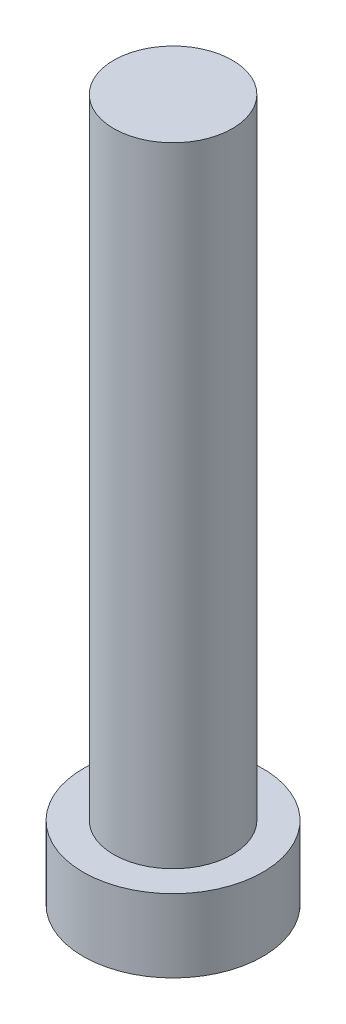
ISO-10303-21;
HEADER;
FILE_DESCRIPTION(('STEP AP214'),'2;1');
FILE_NAME('part.step','',(''),(''),'','','');
FILE_SCHEMA(('AUTOMOTIVE_DESIGN { 1 0 10303 214 1 1 1 1 }'));
ENDSEC;
DATA;
#1=APPLICATION_CONTEXT('core data for automotive mechanical design processes');
#2=APPLICATION_PROTOCOL_DEFINITION('international standard','automotive_design',2000,#1);
#3=PRODUCT_CONTEXT('',#1,'mechanical');
#4=PRODUCT('Part','Part','',(#3));
#5=PRODUCT_RELATED_PRODUCT_CATEGORY('part','',(#4));
#6=PRODUCT_DEFINITION_FORMATION('','',#4);
#7=PRODUCT_DEFINITION_CONTEXT('part definition',#1,'design');
#8=PRODUCT_DEFINITION('design','',#6,#7);
#9=PRODUCT_DEFINITION_SHAPE('','',#8);
#10=(LENGTH_UNIT() NAMED_UNIT(*) SI_UNIT(.MILLI.,.METRE.));
#11=(NAMED_UNIT(*) PLANE_ANGLE_UNIT() SI_UNIT($,.RADIAN.));
#12=(NAMED_UNIT(*) SI_UNIT($,.STERADIAN.) SOLID_ANGLE_UNIT());
#13=UNCERTAINTY_MEASURE_WITH_UNIT(LENGTH_MEASURE(1.E-05),#10,'distance_accuracy_value','');
#14=(GEOMETRIC_REPRESENTATION_CONTEXT(3) GLOBAL_UNCERTAINTY_ASSIGNED_CONTEXT((#13)) GLOBAL_UNIT_ASSIGNED_CONTEXT((#10,
#11,#12)) REPRESENTATION_CONTEXT('',''));
#15=CARTESIAN_POINT('',(0.,0.,0.));
#16=DIRECTION('',(0.,0.,1.));
#17=DIRECTION('',(1.,0.,0.));
#18=AXIS2_PLACEMENT_3D('',#15,#16,#17);
#19=CARTESIAN_POINT('',(0.,4.064,0.));
#20=DIRECTION('',(0.,-1.,0.));
#21=DIRECTION('',(0.,0.,-1.));
#22=AXIS2_PLACEMENT_3D('',#19,#20,#21);
#23=CYLINDRICAL_SURFACE('',#22,5.);
#24=CARTESIAN_POINT('',(0.,4.064,0.));
#25=DIRECTION('',(0.,1.,0.));
#26=DIRECTION('',(0.,0.,1.));
#27=AXIS2_PLACEMENT_3D('',#24,#25,#26);
#28=CIRCLE('',#27,5.);
#29=CARTESIAN_POINT('',(0.,4.064,5.));
#30=VERTEX_POINT('',#29);
#31=EDGE_CURVE('E10',#30,#30,#28,.T.);
#32=ORIENTED_EDGE('',*,*,#31,.F.);
#33=EDGE_LOOP('',(#32));
#34=FACE_BOUND('',#33,.T.);
#35=CARTESIAN_POINT('',(0.,0.,0.));
#36=DIRECTION('',(0.,1.,0.));
#37=DIRECTION('',(0.,0.,1.));
#38=AXIS2_PLACEMENT_3D('',#35,#36,#37);
#39=CIRCLE('',#38,5.);
#40=CARTESIAN_POINT('',(0.,0.,5.));
#41=VERTEX_POINT('',#40);
#42=EDGE_CURVE('E33',#41,#41,#39,.T.);
#43=ORIENTED_EDGE('',*,*,#42,.T.);
#44=EDGE_LOOP('',(#43));
#45=FACE_BOUND('',#44,.T.);
#46=ADVANCED_FACE('F30',(#34,#45),#23,.T.);
#47=CARTESIAN_POINT('',(0.,4.064,0.));
#48=DIRECTION('',(0.,1.,0.));
#49=DIRECTION('',(0.,0.,1.));
#50=AXIS2_PLACEMENT_3D('',#47,#48,#49);
#51=PLANE('',#50);
#52=CARTESIAN_POINT('',(0.,4.064,0.));
#53=DIRECTION('',(0.,1.,0.));
#54=DIRECTION('',(0.,0.,1.));
#55=AXIS2_PLACEMENT_3D('',#52,#53,#54);
#56=CIRCLE('',#55,3.3);
#57=CARTESIAN_POINT('',(0.,4.064,3.3));
#58=VERTEX_POINT('',#57);
#59=EDGE_CURVE('E40',#58,#58,#56,.F.);
#60=ORIENTED_EDGE('',*,*,#59,.T.);
#61=EDGE_LOOP('',(#60));
#62=FACE_BOUND('',#61,.T.);
#63=ORIENTED_EDGE('',*,*,#31,.T.);
#64=EDGE_LOOP('',(#63));
#65=FACE_BOUND('',#64,.T.);
#66=ADVANCED_FACE('F60',(#62,#65),#51,.T.);
#67=CARTESIAN_POINT('',(0.,0.,0.));
#68=DIRECTION('',(0.,1.,0.));
#69=DIRECTION('',(0.,0.,1.));
#70=AXIS2_PLACEMENT_3D('',#67,#68,#69);
#71=PLANE('',#70);
#72=ORIENTED_EDGE('',*,*,#42,.F.);
#73=EDGE_LOOP('',(#72));
#74=FACE_BOUND('',#73,.T.);
#75=ADVANCED_FACE('F52',(#74),#71,.F.);
#76=CARTESIAN_POINT('',(0.,39.0652,0.));
#77=DIRECTION('',(0.,-1.,0.));
#78=DIRECTION('',(0.,0.,-1.));
#79=AXIS2_PLACEMENT_3D('',#76,#77,#78);
#80=CYLINDRICAL_SURFACE('',#79,3.3);
#81=ORIENTED_EDGE('',*,*,#59,.F.);
#82=EDGE_LOOP('',(#81));
#83=FACE_BOUND('',#82,.T.);
#84=CARTESIAN_POINT('',(0.,39.0652,0.));
#85=DIRECTION('',(0.,1.,0.));
#86=DIRECTION('',(0.,0.,1.));
#87=AXIS2_PLACEMENT_3D('',#84,#85,#86);
#88=CIRCLE('',#87,3.3);
#89=CARTESIAN_POINT('',(0.,39.0652,3.3));
#90=VERTEX_POINT('',#89);
#91=EDGE_CURVE('E44',#90,#90,#88,.T.);
#92=ORIENTED_EDGE('',*,*,#91,.F.);
#93=EDGE_LOOP('',(#92));
#94=FACE_BOUND('',#93,.T.);
#95=ADVANCED_FACE('F50',(#83,#94),#80,.T.);
#96=CARTESIAN_POINT('',(0.,39.0652,0.));
#97=DIRECTION('',(0.,1.,0.));
#98=DIRECTION('',(0.,0.,1.));
#99=AXIS2_PLACEMENT_3D('',#96,#97,#98);
#100=PLANE('',#99);
#101=ORIENTED_EDGE('',*,*,#91,.T.);
#102=EDGE_LOOP('',(#101));
#103=FACE_BOUND('',#102,.T.);
#104=ADVANCED_FACE('F48',(#103),#100,.T.);
#105=CLOSED_SHELL('',(#46,#66,#75,#95,#104));
#106=MANIFOLD_SOLID_BREP('B2',#105);
#107=ADVANCED_BREP_SHAPE_REPRESENTATION('',(#18,#106),#14);
#108=SHAPE_DEFINITION_REPRESENTATION(#9,#107);
ENDSEC;
END-ISO-10303-21;
